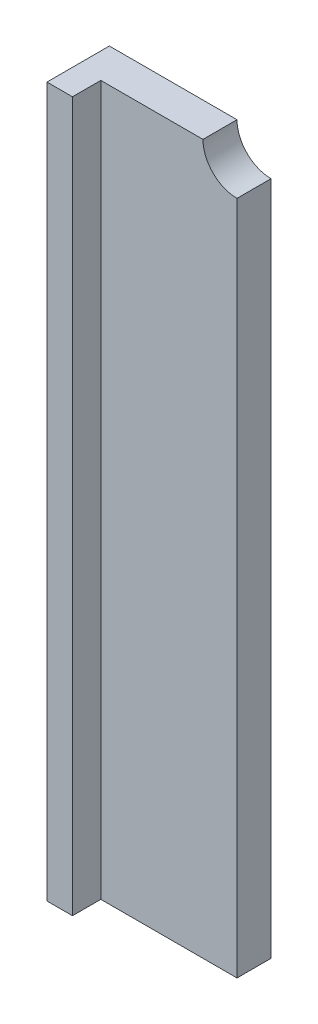
ISO-10303-21;
HEADER;
FILE_DESCRIPTION(('STEP AP214'),'2;1');
FILE_NAME('part.step','',(''),(''),'','','');
FILE_SCHEMA(('AUTOMOTIVE_DESIGN { 1 0 10303 214 1 1 1 1 }'));
ENDSEC;
DATA;
#1=APPLICATION_CONTEXT('core data for automotive mechanical design processes');
#2=APPLICATION_PROTOCOL_DEFINITION('international standard','automotive_design',2000,#1);
#3=PRODUCT_CONTEXT('',#1,'mechanical');
#4=PRODUCT('Part','Part','',(#3));
#5=PRODUCT_RELATED_PRODUCT_CATEGORY('part','',(#4));
#6=PRODUCT_DEFINITION_FORMATION('','',#4);
#7=PRODUCT_DEFINITION_CONTEXT('part definition',#1,'design');
#8=PRODUCT_DEFINITION('design','',#6,#7);
#9=PRODUCT_DEFINITION_SHAPE('','',#8);
#10=(LENGTH_UNIT() NAMED_UNIT(*) SI_UNIT(.MILLI.,.METRE.));
#11=(NAMED_UNIT(*) PLANE_ANGLE_UNIT() SI_UNIT($,.RADIAN.));
#12=(NAMED_UNIT(*) SI_UNIT($,.STERADIAN.) SOLID_ANGLE_UNIT());
#13=UNCERTAINTY_MEASURE_WITH_UNIT(LENGTH_MEASURE(1.E-05),#10,'distance_accuracy_value','');
#14=(GEOMETRIC_REPRESENTATION_CONTEXT(3) GLOBAL_UNCERTAINTY_ASSIGNED_CONTEXT((#13)) GLOBAL_UNIT_ASSIGNED_CONTEXT((#10,
#11,#12)) REPRESENTATION_CONTEXT('',''));
#15=CARTESIAN_POINT('',(0.,0.,0.));
#16=DIRECTION('',(0.,0.,1.));
#17=DIRECTION('',(1.,0.,0.));
#18=AXIS2_PLACEMENT_3D('',#15,#16,#17);
#19=CARTESIAN_POINT('',(0.,0.,6.));
#20=DIRECTION('',(0.,0.,-1.));
#21=DIRECTION('',(-1.,0.,0.));
#22=AXIS2_PLACEMENT_3D('',#19,#20,#21);
#23=PLANE('',#22);
#24=DIRECTION('',(0.,1.,0.));
#25=VECTOR('',#24,1.);
#26=CARTESIAN_POINT('',(28.5,0.,6.));
#27=LINE('',#26,#25);
#28=CARTESIAN_POINT('',(28.5,0.,6.));
#29=VERTEX_POINT('',#28);
#30=CARTESIAN_POINT('',(28.5,119.,6.));
#31=VERTEX_POINT('',#30);
#32=EDGE_CURVE('E115',#29,#31,#27,.T.);
#33=ORIENTED_EDGE('',*,*,#32,.T.);
#34=CARTESIAN_POINT('',(28.5,125.,6.));
#35=DIRECTION('',(0.,0.,1.));
#36=DIRECTION('',(1.,0.,0.));
#37=AXIS2_PLACEMENT_3D('',#34,#35,#36);
#38=CIRCLE('',#37,6.);
#39=CARTESIAN_POINT('',(22.5,125.,6.));
#40=VERTEX_POINT('',#39);
#41=EDGE_CURVE('E98',#40,#31,#38,.T.);
#42=ORIENTED_EDGE('',*,*,#41,.F.);
#43=DIRECTION('',(-1.,0.,0.));
#44=VECTOR('',#43,1.);
#45=CARTESIAN_POINT('',(0.,125.,6.));
#46=LINE('',#45,#44);
#47=CARTESIAN_POINT('',(4.5,125.,6.));
#48=VERTEX_POINT('',#47);
#49=EDGE_CURVE('E106',#40,#48,#46,.T.);
#50=ORIENTED_EDGE('',*,*,#49,.T.);
#51=DIRECTION('',(0.,1.,0.));
#52=VECTOR('',#51,1.);
#53=CARTESIAN_POINT('',(4.5,0.,6.));
#54=LINE('',#53,#52);
#55=CARTESIAN_POINT('',(4.5,0.,6.));
#56=VERTEX_POINT('',#55);
#57=EDGE_CURVE('E56',#56,#48,#54,.T.);
#58=ORIENTED_EDGE('',*,*,#57,.F.);
#59=DIRECTION('',(1.,0.,0.));
#60=VECTOR('',#59,1.);
#61=CARTESIAN_POINT('',(0.,0.,6.));
#62=LINE('',#61,#60);
#63=EDGE_CURVE('E112',#56,#29,#62,.T.);
#64=ORIENTED_EDGE('',*,*,#63,.T.);
#65=EDGE_LOOP('',(#33,#42,#50,#58,#64));
#66=FACE_BOUND('',#65,.T.);
#67=ADVANCED_FACE('F33',(#66),#23,.F.);
#68=CARTESIAN_POINT('',(0.,0.,6.));
#69=DIRECTION('',(1.,0.,0.));
#70=DIRECTION('',(0.,0.,-1.));
#71=AXIS2_PLACEMENT_3D('',#68,#69,#70);
#72=PLANE('',#71);
#73=DIRECTION('',(0.,-1.,0.));
#74=VECTOR('',#73,1.);
#75=CARTESIAN_POINT('',(0.,0.,0.));
#76=LINE('',#75,#74);
#77=CARTESIAN_POINT('',(0.,125.,0.));
#78=VERTEX_POINT('',#77);
#79=CARTESIAN_POINT('',(0.,0.,0.));
#80=VERTEX_POINT('',#79);
#81=EDGE_CURVE('E111',#78,#80,#76,.T.);
#82=ORIENTED_EDGE('',*,*,#81,.T.);
#83=DIRECTION('',(0.,0.,-1.));
#84=VECTOR('',#83,1.);
#85=CARTESIAN_POINT('',(0.,0.,6.));
#86=LINE('',#85,#84);
#87=CARTESIAN_POINT('',(0.,0.,11.));
#88=VERTEX_POINT('',#87);
#89=EDGE_CURVE('E11',#88,#80,#86,.T.);
#90=ORIENTED_EDGE('',*,*,#89,.F.);
#91=DIRECTION('',(0.,-1.,0.));
#92=VECTOR('',#91,1.);
#93=CARTESIAN_POINT('',(0.,0.,11.));
#94=LINE('',#93,#92);
#95=CARTESIAN_POINT('',(0.,125.,11.));
#96=VERTEX_POINT('',#95);
#97=EDGE_CURVE('E147',#96,#88,#94,.T.);
#98=ORIENTED_EDGE('',*,*,#97,.F.);
#99=DIRECTION('',(0.,0.,-1.));
#100=VECTOR('',#99,1.);
#101=CARTESIAN_POINT('',(0.,125.,6.));
#102=LINE('',#101,#100);
#103=EDGE_CURVE('E121',#96,#78,#102,.T.);
#104=ORIENTED_EDGE('',*,*,#103,.T.);
#105=EDGE_LOOP('',(#82,#90,#98,#104));
#106=FACE_BOUND('',#105,.T.);
#107=ADVANCED_FACE('F35',(#106),#72,.F.);
#108=CARTESIAN_POINT('',(0.,0.,6.));
#109=DIRECTION('',(0.,1.,0.));
#110=DIRECTION('',(0.,0.,1.));
#111=AXIS2_PLACEMENT_3D('',#108,#109,#110);
#112=PLANE('',#111);
#113=DIRECTION('',(1.,0.,0.));
#114=VECTOR('',#113,1.);
#115=CARTESIAN_POINT('',(0.,0.,0.));
#116=LINE('',#115,#114);
#117=CARTESIAN_POINT('',(28.5,0.,0.));
#118=VERTEX_POINT('',#117);
#119=EDGE_CURVE('E117',#80,#118,#116,.T.);
#120=ORIENTED_EDGE('',*,*,#119,.T.);
#121=DIRECTION('',(0.,0.,-1.));
#122=VECTOR('',#121,1.);
#123=CARTESIAN_POINT('',(28.5,0.,6.));
#124=LINE('',#123,#122);
#125=EDGE_CURVE('E41',#29,#118,#124,.T.);
#126=ORIENTED_EDGE('',*,*,#125,.F.);
#127=ORIENTED_EDGE('',*,*,#63,.F.);
#128=DIRECTION('',(0.,0.,-1.));
#129=VECTOR('',#128,1.);
#130=CARTESIAN_POINT('',(4.5,0.,11.));
#131=LINE('',#130,#129);
#132=CARTESIAN_POINT('',(4.5,0.,11.));
#133=VERTEX_POINT('',#132);
#134=EDGE_CURVE('E136',#133,#56,#131,.T.);
#135=ORIENTED_EDGE('',*,*,#134,.F.);
#136=DIRECTION('',(1.,0.,0.));
#137=VECTOR('',#136,1.);
#138=CARTESIAN_POINT('',(0.,0.,11.));
#139=LINE('',#138,#137);
#140=EDGE_CURVE('E132',#88,#133,#139,.T.);
#141=ORIENTED_EDGE('',*,*,#140,.F.);
#142=ORIENTED_EDGE('',*,*,#89,.T.);
#143=EDGE_LOOP('',(#120,#126,#127,#135,#141,#142));
#144=FACE_BOUND('',#143,.T.);
#145=ADVANCED_FACE('F130',(#144),#112,.F.);
#146=CARTESIAN_POINT('',(28.5,0.,6.));
#147=DIRECTION('',(-1.,0.,0.));
#148=DIRECTION('',(0.,0.,1.));
#149=AXIS2_PLACEMENT_3D('',#146,#147,#148);
#150=PLANE('',#149);
#151=DIRECTION('',(0.,1.,0.));
#152=VECTOR('',#151,1.);
#153=CARTESIAN_POINT('',(28.5,0.,0.));
#154=LINE('',#153,#152);
#155=CARTESIAN_POINT('',(28.5,119.,0.));
#156=VERTEX_POINT('',#155);
#157=EDGE_CURVE('E113',#118,#156,#154,.T.);
#158=ORIENTED_EDGE('',*,*,#157,.T.);
#159=DIRECTION('',(0.,0.,1.));
#160=VECTOR('',#159,1.);
#161=CARTESIAN_POINT('',(28.5,119.,0.));
#162=LINE('',#161,#160);
#163=EDGE_CURVE('E48',#156,#31,#162,.T.);
#164=ORIENTED_EDGE('',*,*,#163,.T.);
#165=ORIENTED_EDGE('',*,*,#32,.F.);
#166=ORIENTED_EDGE('',*,*,#125,.T.);
#167=EDGE_LOOP('',(#158,#164,#165,#166));
#168=FACE_BOUND('',#167,.T.);
#169=ADVANCED_FACE('F126',(#168),#150,.F.);
#170=CARTESIAN_POINT('',(0.,125.,6.));
#171=DIRECTION('',(0.,-1.,0.));
#172=DIRECTION('',(0.,0.,-1.));
#173=AXIS2_PLACEMENT_3D('',#170,#171,#172);
#174=PLANE('',#173);
#175=ORIENTED_EDGE('',*,*,#49,.F.);
#176=DIRECTION('',(0.,0.,1.));
#177=VECTOR('',#176,1.);
#178=CARTESIAN_POINT('',(22.5,125.,0.));
#179=LINE('',#178,#177);
#180=CARTESIAN_POINT('',(22.5,125.,0.));
#181=VERTEX_POINT('',#180);
#182=EDGE_CURVE('E92',#40,#181,#179,.F.);
#183=ORIENTED_EDGE('',*,*,#182,.T.);
#184=DIRECTION('',(-1.,0.,0.));
#185=VECTOR('',#184,1.);
#186=CARTESIAN_POINT('',(0.,125.,0.));
#187=LINE('',#186,#185);
#188=EDGE_CURVE('E103',#181,#78,#187,.T.);
#189=ORIENTED_EDGE('',*,*,#188,.T.);
#190=ORIENTED_EDGE('',*,*,#103,.F.);
#191=DIRECTION('',(-1.,0.,0.));
#192=VECTOR('',#191,1.);
#193=CARTESIAN_POINT('',(0.,125.,11.));
#194=LINE('',#193,#192);
#195=CARTESIAN_POINT('',(4.5,125.,11.));
#196=VERTEX_POINT('',#195);
#197=EDGE_CURVE('E145',#196,#96,#194,.T.);
#198=ORIENTED_EDGE('',*,*,#197,.F.);
#199=DIRECTION('',(0.,0.,-1.));
#200=VECTOR('',#199,1.);
#201=CARTESIAN_POINT('',(4.5,125.,11.));
#202=LINE('',#201,#200);
#203=EDGE_CURVE('E139',#196,#48,#202,.T.);
#204=ORIENTED_EDGE('',*,*,#203,.T.);
#205=EDGE_LOOP('',(#175,#183,#189,#190,#198,#204));
#206=FACE_BOUND('',#205,.T.);
#207=ADVANCED_FACE('F102',(#206),#174,.F.);
#208=CARTESIAN_POINT('',(0.,0.,0.));
#209=DIRECTION('',(0.,0.,-1.));
#210=DIRECTION('',(-1.,0.,0.));
#211=AXIS2_PLACEMENT_3D('',#208,#209,#210);
#212=PLANE('',#211);
#213=CARTESIAN_POINT('',(28.5,125.,0.));
#214=DIRECTION('',(0.,0.,1.));
#215=DIRECTION('',(1.,0.,0.));
#216=AXIS2_PLACEMENT_3D('',#213,#214,#215);
#217=CIRCLE('',#216,6.);
#218=EDGE_CURVE('E89',#181,#156,#217,.T.);
#219=ORIENTED_EDGE('',*,*,#218,.T.);
#220=ORIENTED_EDGE('',*,*,#157,.F.);
#221=ORIENTED_EDGE('',*,*,#119,.F.);
#222=ORIENTED_EDGE('',*,*,#81,.F.);
#223=ORIENTED_EDGE('',*,*,#188,.F.);
#224=EDGE_LOOP('',(#219,#220,#221,#222,#223));
#225=FACE_BOUND('',#224,.T.);
#226=ADVANCED_FACE('F109',(#225),#212,.T.);
#227=CARTESIAN_POINT('',(4.5,0.,11.));
#228=DIRECTION('',(-1.,0.,0.));
#229=DIRECTION('',(0.,0.,1.));
#230=AXIS2_PLACEMENT_3D('',#227,#228,#229);
#231=PLANE('',#230);
#232=ORIENTED_EDGE('',*,*,#57,.T.);
#233=ORIENTED_EDGE('',*,*,#203,.F.);
#234=DIRECTION('',(0.,1.,0.));
#235=VECTOR('',#234,1.);
#236=CARTESIAN_POINT('',(4.5,0.,11.));
#237=LINE('',#236,#235);
#238=EDGE_CURVE('E150',#133,#196,#237,.T.);
#239=ORIENTED_EDGE('',*,*,#238,.F.);
#240=ORIENTED_EDGE('',*,*,#134,.T.);
#241=EDGE_LOOP('',(#232,#233,#239,#240));
#242=FACE_BOUND('',#241,.T.);
#243=ADVANCED_FACE('F157',(#242),#231,.F.);
#244=CARTESIAN_POINT('',(0.,0.,11.));
#245=DIRECTION('',(0.,0.,-1.));
#246=DIRECTION('',(-1.,0.,0.));
#247=AXIS2_PLACEMENT_3D('',#244,#245,#246);
#248=PLANE('',#247);
#249=ORIENTED_EDGE('',*,*,#97,.T.);
#250=ORIENTED_EDGE('',*,*,#140,.T.);
#251=ORIENTED_EDGE('',*,*,#238,.T.);
#252=ORIENTED_EDGE('',*,*,#197,.T.);
#253=EDGE_LOOP('',(#249,#250,#251,#252));
#254=FACE_BOUND('',#253,.T.);
#255=ADVANCED_FACE('F161',(#254),#248,.F.);
#256=CARTESIAN_POINT('',(28.5,125.,0.));
#257=DIRECTION('',(0.,0.,1.));
#258=DIRECTION('',(1.,0.,0.));
#259=AXIS2_PLACEMENT_3D('',#256,#257,#258);
#260=CYLINDRICAL_SURFACE('',#259,6.);
#261=ORIENTED_EDGE('',*,*,#218,.F.);
#262=ORIENTED_EDGE('',*,*,#182,.F.);
#263=ORIENTED_EDGE('',*,*,#41,.T.);
#264=ORIENTED_EDGE('',*,*,#163,.F.);
#265=EDGE_LOOP('',(#261,#262,#263,#264));
#266=FACE_BOUND('',#265,.T.);
#267=ADVANCED_FACE('F91',(#266),#260,.F.);
#268=CLOSED_SHELL('',(#67,#107,#145,#169,#207,#226,#243,#255,#267));
#269=MANIFOLD_SOLID_BREP('B2',#268);
#270=ADVANCED_BREP_SHAPE_REPRESENTATION('',(#18,#269),#14);
#271=SHAPE_DEFINITION_REPRESENTATION(#9,#270);
ENDSEC;
END-ISO-10303-21;
